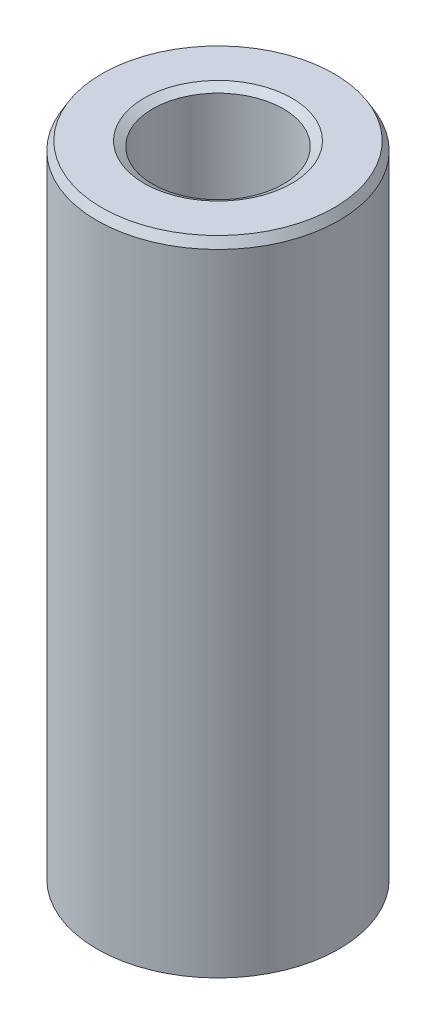
ISO-10303-21;
HEADER;
FILE_DESCRIPTION(('STEP AP214'),'2;1');
FILE_NAME('part.step','',(''),(''),'','','');
FILE_SCHEMA(('AUTOMOTIVE_DESIGN { 1 0 10303 214 1 1 1 1 }'));
ENDSEC;
DATA;
#1=APPLICATION_CONTEXT('core data for automotive mechanical design processes');
#2=APPLICATION_PROTOCOL_DEFINITION('international standard','automotive_design',2000,#1);
#3=PRODUCT_CONTEXT('',#1,'mechanical');
#4=PRODUCT('Part','Part','',(#3));
#5=PRODUCT_RELATED_PRODUCT_CATEGORY('part','',(#4));
#6=PRODUCT_DEFINITION_FORMATION('','',#4);
#7=PRODUCT_DEFINITION_CONTEXT('part definition',#1,'design');
#8=PRODUCT_DEFINITION('design','',#6,#7);
#9=PRODUCT_DEFINITION_SHAPE('','',#8);
#10=(LENGTH_UNIT() NAMED_UNIT(*) SI_UNIT(.MILLI.,.METRE.));
#11=(NAMED_UNIT(*) PLANE_ANGLE_UNIT() SI_UNIT($,.RADIAN.));
#12=(NAMED_UNIT(*) SI_UNIT($,.STERADIAN.) SOLID_ANGLE_UNIT());
#13=UNCERTAINTY_MEASURE_WITH_UNIT(LENGTH_MEASURE(1.E-05),#10,'distance_accuracy_value','');
#14=(GEOMETRIC_REPRESENTATION_CONTEXT(3) GLOBAL_UNCERTAINTY_ASSIGNED_CONTEXT((#13)) GLOBAL_UNIT_ASSIGNED_CONTEXT((#10,
#11,#12)) REPRESENTATION_CONTEXT('',''));
#15=CARTESIAN_POINT('',(0.,0.,0.));
#16=DIRECTION('',(0.,0.,1.));
#17=DIRECTION('',(1.,0.,0.));
#18=AXIS2_PLACEMENT_3D('',#15,#16,#17);
#19=CARTESIAN_POINT('',(0.,186.292931904023,0.));
#20=DIRECTION('',(0.,-1.,0.));
#21=DIRECTION('',(0.,0.,-1.));
#22=AXIS2_PLACEMENT_3D('',#19,#20,#21);
#23=CYLINDRICAL_SURFACE('',#22,35.);
#24=CARTESIAN_POINT('',(0.,1.43433739245358,0.));
#25=DIRECTION('',(0.,1.,0.));
#26=DIRECTION('',(0.,0.,1.));
#27=AXIS2_PLACEMENT_3D('',#24,#25,#26);
#28=CIRCLE('',#27,35.);
#29=CARTESIAN_POINT('',(0.,1.43433739245358,35.));
#30=VERTEX_POINT('',#29);
#31=EDGE_CURVE('E10',#30,#30,#28,.T.);
#32=ORIENTED_EDGE('',*,*,#31,.T.);
#33=EDGE_LOOP('',(#32));
#34=FACE_BOUND('',#33,.T.);
#35=CARTESIAN_POINT('',(0.,183.808586665098,0.));
#36=DIRECTION('',(0.,1.,0.));
#37=DIRECTION('',(0.,0.,1.));
#38=AXIS2_PLACEMENT_3D('',#35,#36,#37);
#39=CIRCLE('',#38,35.);
#40=CARTESIAN_POINT('',(0.,183.808586665098,35.));
#41=VERTEX_POINT('',#40);
#42=EDGE_CURVE('E50',#41,#41,#39,.F.);
#43=ORIENTED_EDGE('',*,*,#42,.T.);
#44=EDGE_LOOP('',(#43));
#45=FACE_BOUND('',#44,.T.);
#46=ADVANCED_FACE('F39',(#34,#45),#23,.T.);
#47=CARTESIAN_POINT('',(0.,186.292931904023,0.));
#48=DIRECTION('',(0.,1.,0.));
#49=DIRECTION('',(0.,0.,1.));
#50=AXIS2_PLACEMENT_3D('',#47,#48,#49);
#51=PLANE('',#50);
#52=CARTESIAN_POINT('',(0.,186.292931904023,0.));
#53=DIRECTION('',(0.,1.,0.));
#54=DIRECTION('',(0.,0.,1.));
#55=AXIS2_PLACEMENT_3D('',#52,#53,#54);
#56=CIRCLE('',#55,21.3663283870404);
#57=CARTESIAN_POINT('',(0.,186.292931904023,21.3663283870404));
#58=VERTEX_POINT('',#57);
#59=EDGE_CURVE('E58',#58,#58,#56,.F.);
#60=ORIENTED_EDGE('',*,*,#59,.T.);
#61=EDGE_LOOP('',(#60));
#62=FACE_BOUND('',#61,.T.);
#63=CARTESIAN_POINT('',(0.,186.292931904023,0.));
#64=DIRECTION('',(0.,1.,0.));
#65=DIRECTION('',(0.,0.,1.));
#66=AXIS2_PLACEMENT_3D('',#63,#64,#65);
#67=CIRCLE('',#66,33.5656626075465);
#68=CARTESIAN_POINT('',(0.,186.292931904023,33.5656626075465));
#69=VERTEX_POINT('',#68);
#70=EDGE_CURVE('E61',#69,#69,#67,.T.);
#71=ORIENTED_EDGE('',*,*,#70,.T.);
#72=EDGE_LOOP('',(#71));
#73=FACE_BOUND('',#72,.T.);
#74=ADVANCED_FACE('F88',(#62,#73),#51,.T.);
#75=CARTESIAN_POINT('',(0.,0.,0.));
#76=DIRECTION('',(0.,1.,0.));
#77=DIRECTION('',(0.,0.,1.));
#78=AXIS2_PLACEMENT_3D('',#75,#76,#77);
#79=PLANE('',#78);
#80=CARTESIAN_POINT('',(0.,0.,0.));
#81=DIRECTION('',(0.,1.,0.));
#82=DIRECTION('',(0.,0.,1.));
#83=AXIS2_PLACEMENT_3D('',#80,#81,#82);
#84=CIRCLE('',#83,20.3163205405685);
#85=CARTESIAN_POINT('',(0.,0.,-20.3163205405685));
#86=VERTEX_POINT('',#85);
#87=EDGE_CURVE('E51',#86,#86,#84,.T.);
#88=ORIENTED_EDGE('',*,*,#87,.T.);
#89=EDGE_LOOP('',(#88));
#90=FACE_BOUND('',#89,.T.);
#91=CARTESIAN_POINT('',(0.,0.,0.));
#92=DIRECTION('',(0.,1.,0.));
#93=DIRECTION('',(0.,0.,1.));
#94=AXIS2_PLACEMENT_3D('',#91,#92,#93);
#95=CIRCLE('',#94,32.5156547610745);
#96=CARTESIAN_POINT('',(0.,0.,32.5156547610745));
#97=VERTEX_POINT('',#96);
#98=EDGE_CURVE('E54',#97,#97,#95,.F.);
#99=ORIENTED_EDGE('',*,*,#98,.T.);
#100=EDGE_LOOP('',(#99));
#101=FACE_BOUND('',#100,.T.);
#102=ADVANCED_FACE('F83',(#90,#101),#79,.F.);
#103=CARTESIAN_POINT('',(0.,186.292931904023,0.));
#104=DIRECTION('',(0.,-1.,0.));
#105=DIRECTION('',(0.,0.,-1.));
#106=AXIS2_PLACEMENT_3D('',#103,#104,#105);
#107=CYLINDRICAL_SURFACE('',#106,18.8819831481149);
#108=CARTESIAN_POINT('',(0.,184.858594511569,0.));
#109=DIRECTION('',(0.,1.,0.));
#110=DIRECTION('',(0.,0.,1.));
#111=AXIS2_PLACEMENT_3D('',#108,#109,#110);
#112=CIRCLE('',#111,18.8819831481149);
#113=CARTESIAN_POINT('',(0.,184.858594511569,18.8819831481149));
#114=VERTEX_POINT('',#113);
#115=EDGE_CURVE('E67',#114,#114,#112,.T.);
#116=ORIENTED_EDGE('',*,*,#115,.T.);
#117=EDGE_LOOP('',(#116));
#118=FACE_BOUND('',#117,.T.);
#119=CARTESIAN_POINT('',(0.,2.48434523892552,0.));
#120=DIRECTION('',(0.,1.,0.));
#121=DIRECTION('',(0.,0.,1.));
#122=AXIS2_PLACEMENT_3D('',#119,#120,#121);
#123=CIRCLE('',#122,18.8819831481149);
#124=CARTESIAN_POINT('',(0.,2.48434523892552,-18.8819831481149));
#125=VERTEX_POINT('',#124);
#126=EDGE_CURVE('E69',#125,#125,#123,.F.);
#127=ORIENTED_EDGE('',*,*,#126,.T.);
#128=EDGE_LOOP('',(#127));
#129=FACE_BOUND('',#128,.T.);
#130=ADVANCED_FACE('F71',(#118,#129),#107,.F.);
#131=CARTESIAN_POINT('',(0.,184.858594511569,0.));
#132=DIRECTION('',(0.,1.,0.));
#133=DIRECTION('',(0.,0.,1.));
#134=AXIS2_PLACEMENT_3D('',#131,#132,#133);
#135=CONICAL_SURFACE('',#134,18.8819831481149,1.0471975511966);
#136=ORIENTED_EDGE('',*,*,#59,.F.);
#137=EDGE_LOOP('',(#136));
#138=FACE_BOUND('',#137,.T.);
#139=ORIENTED_EDGE('',*,*,#115,.F.);
#140=EDGE_LOOP('',(#139));
#141=FACE_BOUND('',#140,.T.);
#142=ADVANCED_FACE('F77',(#138,#141),#135,.F.);
#143=CARTESIAN_POINT('',(0.,0.,0.));
#144=DIRECTION('',(0.,-1.,0.));
#145=DIRECTION('',(0.,0.,-1.));
#146=AXIS2_PLACEMENT_3D('',#143,#144,#145);
#147=CONICAL_SURFACE('',#146,20.3163205405685,0.523598775598298);
#148=CARTESIAN_POINT('',(0.,2.48434523892552,-18.8819831481149));
#149=CARTESIAN_POINT('',(0.,2.45846664268671,-18.8969241626197));
#150=CARTESIAN_POINT('',(0.,2.4325880464479,-18.9118651771244));
#151=CARTESIAN_POINT('',(0.,2.38083085397029,-18.9417472061338));
#152=CARTESIAN_POINT('',(0.,2.35495225773148,-18.9566882206386));
#153=CARTESIAN_POINT('',(0.,2.30319506525387,-18.986570249648));
#154=CARTESIAN_POINT('',(0.,2.27731646901506,-19.0015112641527));
#155=CARTESIAN_POINT('',(0.,2.22555927653744,-19.0313932931622));
#156=CARTESIAN_POINT('',(0.,2.19968068029863,-19.0463343076669));
#157=CARTESIAN_POINT('',(0.,2.14792348782102,-19.0762163366764));
#158=CARTESIAN_POINT('',(0.,2.12204489158221,-19.0911573511811));
#159=CARTESIAN_POINT('',(0.,2.0702876991046,-19.1210393801905));
#160=CARTESIAN_POINT('',(0.,2.04440910286579,-19.1359803946953));
#161=CARTESIAN_POINT('',(0.,1.99265191038818,-19.1658624237047));
#162=CARTESIAN_POINT('',(0.,1.96677331414937,-19.1808034382094));
#163=CARTESIAN_POINT('',(0.,1.91501612167175,-19.2106854672189));
#164=CARTESIAN_POINT('',(0.,1.88913752543294,-19.2256264817236));
#165=CARTESIAN_POINT('',(0.,1.83738033295533,-19.2555085107331));
#166=CARTESIAN_POINT('',(0.,1.81150173671652,-19.2704495252378));
#167=CARTESIAN_POINT('',(0.,1.75974454423891,-19.3003315542472));
#168=CARTESIAN_POINT('',(0.,1.7338659480001,-19.315272568752));
#169=CARTESIAN_POINT('',(0.,1.68210875552249,-19.3451545977614));
#170=CARTESIAN_POINT('',(0.,1.65623015928368,-19.3600956122661));
#171=CARTESIAN_POINT('',(0.,1.60447296680606,-19.3899776412756));
#172=CARTESIAN_POINT('',(0.,1.57859437056726,-19.4049186557803));
#173=CARTESIAN_POINT('',(0.,1.52683717808964,-19.4348006847898));
#174=CARTESIAN_POINT('',(0.,1.50095858185083,-19.4497416992945));
#175=CARTESIAN_POINT('',(0.,1.44920138937322,-19.4796237283039));
#176=CARTESIAN_POINT('',(0.,1.42332279313441,-19.4945647428087));
#177=CARTESIAN_POINT('',(0.,1.3715656006568,-19.5244467718181));
#178=CARTESIAN_POINT('',(0.,1.34568700441799,-19.5393877863228));
#179=CARTESIAN_POINT('',(0.,1.29392981194037,-19.5692698153323));
#180=CARTESIAN_POINT('',(0.,1.26805121570157,-19.584210829837));
#181=CARTESIAN_POINT('',(0.,1.21629402322395,-19.6140928588465));
#182=CARTESIAN_POINT('',(0.,1.19041542698514,-19.6290338733512));
#183=CARTESIAN_POINT('',(0.,1.13865823450753,-19.6589159023606));
#184=CARTESIAN_POINT('',(0.,1.11277963826872,-19.6738569168654));
#185=CARTESIAN_POINT('',(0.,1.06102244579111,-19.7037389458748));
#186=CARTESIAN_POINT('',(0.,1.0351438495523,-19.7186799603795));
#187=CARTESIAN_POINT('',(0.,0.983386657074683,-19.748561989389));
#188=CARTESIAN_POINT('',(0.,0.957508060835876,-19.7635030038937));
#189=CARTESIAN_POINT('',(0.,0.905750868358262,-19.7933850329032));
#190=CARTESIAN_POINT('',(0.,0.879872272119454,-19.8083260474079));
#191=CARTESIAN_POINT('',(0.,0.828115079641839,-19.8382080764173));
#192=CARTESIAN_POINT('',(0.,0.802236483403031,-19.8531490909221));
#193=CARTESIAN_POINT('',(0.,0.750479290925417,-19.8830311199315));
#194=CARTESIAN_POINT('',(0.,0.724600694686609,-19.8979721344362));
#195=CARTESIAN_POINT('',(0.,0.672843502208994,-19.9278541634457));
#196=CARTESIAN_POINT('',(0.,0.646964905970187,-19.9427951779504));
#197=CARTESIAN_POINT('',(0.,0.595207713492572,-19.9726772069599));
#198=CARTESIAN_POINT('',(0.,0.569329117253764,-19.9876182214646));
#199=CARTESIAN_POINT('',(0.,0.517571924776149,-20.017500250474));
#200=CARTESIAN_POINT('',(0.,0.491693328537341,-20.0324412649788));
#201=CARTESIAN_POINT('',(0.,0.439936136059727,-20.0623232939882));
#202=CARTESIAN_POINT('',(0.,0.41405753982092,-20.0772643084929));
#203=CARTESIAN_POINT('',(0.,0.362300347343305,-20.1071463375024));
#204=CARTESIAN_POINT('',(0.,0.336421751104497,-20.1220873520071));
#205=CARTESIAN_POINT('',(0.,0.284664558626882,-20.1519693810166));
#206=CARTESIAN_POINT('',(0.,0.258785962388075,-20.1669103955213));
#207=CARTESIAN_POINT('',(0.,0.20702876991046,-20.1967924245307));
#208=CARTESIAN_POINT('',(0.,0.181150173671652,-20.2117334390355));
#209=CARTESIAN_POINT('',(0.,0.129392981194037,-20.2416154680449));
#210=CARTESIAN_POINT('',(0.,0.10351438495523,-20.2565564825496));
#211=CARTESIAN_POINT('',(0.,0.0517571924776154,-20.2864385115591));
#212=CARTESIAN_POINT('',(0.,0.0258785962388082,-20.3013795260638));
#213=CARTESIAN_POINT('',(0.,0.,-20.3163205405685));
#214=B_SPLINE_CURVE_WITH_KNOTS('',3,(#148,#149,#150,#151,#152,#153,#154,#155,#156,#157,#158,
#159,#160,#161,#162,#163,#164,#165,#166,#167,#168,#169,#170,#171,#172,#173,#174,#175,#176,#177,
#178,#179,#180,#181,#182,#183,#184,#185,#186,#187,#188,#189,#190,#191,#192,#193,#194,#195,#196,
#197,#198,#199,#200,#201,#202,#203,#204,#205,#206,#207,#208,#209,#210,#211,#212,#213),
.UNSPECIFIED.,.F.,.F.,(4,2,2,2,2,2,2,2,2,2,2,2,2,2,2,2,2,2,2,2,2,2,2,2,2,2,2,2,2,2,2,2,4),(0.,
0.0896460870283502,0.179292174056702,0.268938261085052,0.358584348113403,0.448230435141753,
0.537876522170105,0.627522609198455,0.717168696226805,0.806814783255157,0.896460870283507,
0.986106957311857,1.07575304434021,1.16539913136856,1.25504521839691,1.34469130542526,
1.43433739245361,1.52398347948196,1.61362956651031,1.70327565353866,1.79292174056702,
1.88256782759537,1.97221391462372,2.06186000165207,2.15150608868042,2.24115217570877,
2.33079826273712,2.42044434976547,2.51009043679382,2.59973652382217,2.68938261085052,
2.77902869787887,2.86867478490722),.UNSPECIFIED.);
#215=EDGE_CURVE('BSEAM73',#125,#86,#214,.T.);
#216=ORIENTED_EDGE('',*,*,#126,.F.);
#217=ORIENTED_EDGE('',*,*,#87,.F.);
#218=ORIENTED_EDGE('',*,*,#215,.T.);
#219=ORIENTED_EDGE('',*,*,#215,.F.);
#220=EDGE_LOOP('',(#216,#218,#217,#219));
#221=FACE_BOUND('',#220,.T.);
#222=ADVANCED_FACE('F73',(#221),#147,.F.);
#223=CARTESIAN_POINT('',(0.,1.43433739245358,0.));
#224=DIRECTION('',(0.,1.,0.));
#225=DIRECTION('',(0.,0.,1.));
#226=AXIS2_PLACEMENT_3D('',#223,#224,#225);
#227=CONICAL_SURFACE('',#226,35.,1.0471975511966);
#228=ORIENTED_EDGE('',*,*,#98,.F.);
#229=EDGE_LOOP('',(#228));
#230=FACE_BOUND('',#229,.T.);
#231=ORIENTED_EDGE('',*,*,#31,.F.);
#232=EDGE_LOOP('',(#231));
#233=FACE_BOUND('',#232,.T.);
#234=ADVANCED_FACE('F76',(#230,#233),#227,.T.);
#235=CARTESIAN_POINT('',(0.,186.292931904023,0.));
#236=DIRECTION('',(0.,-1.,0.));
#237=DIRECTION('',(0.,0.,-1.));
#238=AXIS2_PLACEMENT_3D('',#235,#236,#237);
#239=CONICAL_SURFACE('',#238,33.5656626075465,0.523598775598296);
#240=ORIENTED_EDGE('',*,*,#42,.F.);
#241=EDGE_LOOP('',(#240));
#242=FACE_BOUND('',#241,.T.);
#243=ORIENTED_EDGE('',*,*,#70,.F.);
#244=EDGE_LOOP('',(#243));
#245=FACE_BOUND('',#244,.T.);
#246=ADVANCED_FACE('F45',(#242,#245),#239,.T.);
#247=CLOSED_SHELL('',(#46,#74,#102,#130,#142,#222,#234,#246));
#248=MANIFOLD_SOLID_BREP('B2',#247);
#249=ADVANCED_BREP_SHAPE_REPRESENTATION('',(#18,#248),#14);
#250=SHAPE_DEFINITION_REPRESENTATION(#9,#249);
ENDSEC;
END-ISO-10303-21;
